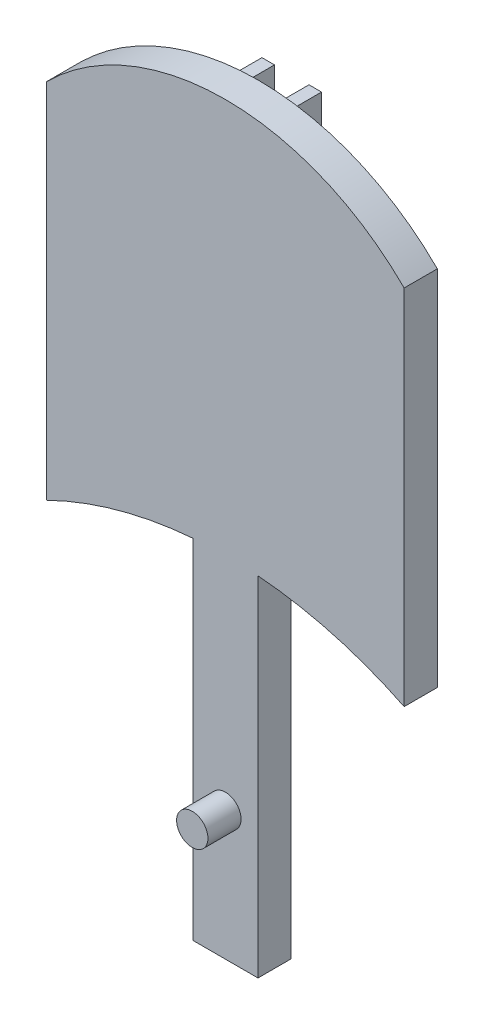
ISO-10303-21;
HEADER;
FILE_DESCRIPTION(('STEP AP214'),'2;1');
FILE_NAME('part.step','',(''),(''),'','','');
FILE_SCHEMA(('AUTOMOTIVE_DESIGN { 1 0 10303 214 1 1 1 1 }'));
ENDSEC;
DATA;
#1=APPLICATION_CONTEXT('core data for automotive mechanical design processes');
#2=APPLICATION_PROTOCOL_DEFINITION('international standard','automotive_design',2000,#1);
#3=PRODUCT_CONTEXT('',#1,'mechanical');
#4=PRODUCT('Part','Part','',(#3));
#5=PRODUCT_RELATED_PRODUCT_CATEGORY('part','',(#4));
#6=PRODUCT_DEFINITION_FORMATION('','',#4);
#7=PRODUCT_DEFINITION_CONTEXT('part definition',#1,'design');
#8=PRODUCT_DEFINITION('design','',#6,#7);
#9=PRODUCT_DEFINITION_SHAPE('','',#8);
#10=(LENGTH_UNIT() NAMED_UNIT(*) SI_UNIT(.MILLI.,.METRE.));
#11=(NAMED_UNIT(*) PLANE_ANGLE_UNIT() SI_UNIT($,.RADIAN.));
#12=(NAMED_UNIT(*) SI_UNIT($,.STERADIAN.) SOLID_ANGLE_UNIT());
#13=UNCERTAINTY_MEASURE_WITH_UNIT(LENGTH_MEASURE(1.E-05),#10,'distance_accuracy_value','');
#14=(GEOMETRIC_REPRESENTATION_CONTEXT(3) GLOBAL_UNCERTAINTY_ASSIGNED_CONTEXT((#13)) GLOBAL_UNIT_ASSIGNED_CONTEXT((#10,
#11,#12)) REPRESENTATION_CONTEXT('',''));
#15=CARTESIAN_POINT('',(0.,0.,0.));
#16=DIRECTION('',(0.,0.,1.));
#17=DIRECTION('',(1.,0.,0.));
#18=AXIS2_PLACEMENT_3D('',#15,#16,#17);
#19=CARTESIAN_POINT('',(0.,-52.2146947063219,3.175));
#20=DIRECTION('',(0.,0.,-1.));
#21=DIRECTION('',(-1.,0.,0.));
#22=AXIS2_PLACEMENT_3D('',#19,#20,#21);
#23=CYLINDRICAL_SURFACE('',#22,38.8318920153463);
#24=CARTESIAN_POINT('',(0.,-52.2146947063219,3.175));
#25=DIRECTION('',(0.,0.,1.));
#26=DIRECTION('',(1.,0.,0.));
#27=AXIS2_PLACEMENT_3D('',#24,#25,#26);
#28=CIRCLE('',#27,38.8318920153463);
#29=CARTESIAN_POINT('',(3.11847985069034,-13.5082234009658,3.175));
#30=VERTEX_POINT('',#29);
#31=CARTESIAN_POINT('',(17.1142533328683,-17.3575839489754,3.175));
#32=VERTEX_POINT('',#31);
#33=EDGE_CURVE('E260',#30,#32,#28,.F.);
#34=ORIENTED_EDGE('',*,*,#33,.F.);
#35=DIRECTION('',(0.,0.,-1.));
#36=VECTOR('',#35,1.);
#37=CARTESIAN_POINT('',(3.11847985069034,-13.5082234009658,3.175));
#38=LINE('',#37,#36);
#39=CARTESIAN_POINT('',(3.11847985069034,-13.5082234009658,0.));
#40=VERTEX_POINT('',#39);
#41=EDGE_CURVE('E193',#30,#40,#38,.T.);
#42=ORIENTED_EDGE('',*,*,#41,.T.);
#43=CARTESIAN_POINT('',(0.,-52.2146947063219,0.));
#44=DIRECTION('',(0.,0.,1.));
#45=DIRECTION('',(1.,0.,0.));
#46=AXIS2_PLACEMENT_3D('',#43,#44,#45);
#47=CIRCLE('',#46,38.8318920153463);
#48=CARTESIAN_POINT('',(17.1142533328683,-17.3575839489754,0.));
#49=VERTEX_POINT('',#48);
#50=EDGE_CURVE('E272',#40,#49,#47,.F.);
#51=ORIENTED_EDGE('',*,*,#50,.T.);
#52=DIRECTION('',(0.,0.,-1.));
#53=VECTOR('',#52,1.);
#54=CARTESIAN_POINT('',(17.1142533328683,-17.3575839489754,3.175));
#55=LINE('',#54,#53);
#56=EDGE_CURVE('E278',#32,#49,#55,.T.);
#57=ORIENTED_EDGE('',*,*,#56,.F.);
#58=EDGE_LOOP('',(#34,#42,#51,#57));
#59=FACE_BOUND('',#58,.T.);
#60=ADVANCED_FACE('F41',(#59),#23,.F.);
#61=CARTESIAN_POINT('',(0.,-52.2146947063219,0.));
#62=DIRECTION('',(0.,0.,1.));
#63=DIRECTION('',(1.,0.,0.));
#64=AXIS2_PLACEMENT_3D('',#61,#62,#63);
#65=CIRCLE('',#64,38.8318920153463);
#66=CARTESIAN_POINT('',(-2.85342673515783,-13.4877816695383,0.));
#67=VERTEX_POINT('',#66);
#68=CARTESIAN_POINT('',(-1.65128861988301,-13.4179283025949,0.));
#69=VERTEX_POINT('',#68);
#70=EDGE_CURVE('E190',#67,#69,#65,.F.);
#71=ORIENTED_EDGE('',*,*,#70,.F.);
#72=DIRECTION('',(0.,0.,1.));
#73=VECTOR('',#72,1.);
#74=CARTESIAN_POINT('',(-2.85342673515783,-13.4877816695383,-3.175));
#75=LINE('',#74,#73);
#76=CARTESIAN_POINT('',(-2.85342673515783,-13.4877816695383,-3.175));
#77=VERTEX_POINT('',#76);
#78=EDGE_CURVE('E211',#77,#67,#75,.T.);
#79=ORIENTED_EDGE('',*,*,#78,.F.);
#80=CARTESIAN_POINT('',(0.,-52.2146947063219,-3.175));
#81=DIRECTION('',(0.,0.,-1.));
#82=DIRECTION('',(-1.,0.,0.));
#83=AXIS2_PLACEMENT_3D('',#80,#81,#82);
#84=CIRCLE('',#83,38.8318920153463);
#85=CARTESIAN_POINT('',(-1.65128861988301,-13.4179283025949,-3.175));
#86=VERTEX_POINT('',#85);
#87=EDGE_CURVE('E225',#86,#77,#84,.F.);
#88=ORIENTED_EDGE('',*,*,#87,.F.);
#89=DIRECTION('',(0.,0.,1.));
#90=VECTOR('',#89,1.);
#91=CARTESIAN_POINT('',(-1.65128861988301,-13.4179283025949,-3.175));
#92=LINE('',#91,#90);
#93=EDGE_CURVE('E237',#86,#69,#92,.T.);
#94=ORIENTED_EDGE('',*,*,#93,.T.);
#95=EDGE_LOOP('',(#71,#79,#88,#94));
#96=FACE_BOUND('',#95,.T.);
#97=ADVANCED_FACE('F330',(#96),#23,.F.);
#98=CARTESIAN_POINT('',(1.65128861988301,-13.4179283025949,0.));
#99=VERTEX_POINT('',#98);
#100=CARTESIAN_POINT('',(2.85342673515783,-13.4877816695383,0.));
#101=VERTEX_POINT('',#100);
#102=EDGE_CURVE('E188',#99,#101,#65,.F.);
#103=ORIENTED_EDGE('',*,*,#102,.F.);
#104=DIRECTION('',(0.,0.,1.));
#105=VECTOR('',#104,1.);
#106=CARTESIAN_POINT('',(1.65128861988301,-13.4179283025949,-3.175));
#107=LINE('',#106,#105);
#108=CARTESIAN_POINT('',(1.65128861988301,-13.4179283025949,-3.175));
#109=VERTEX_POINT('',#108);
#110=EDGE_CURVE('E208',#109,#99,#107,.T.);
#111=ORIENTED_EDGE('',*,*,#110,.F.);
#112=CARTESIAN_POINT('',(0.,-52.2146947063219,-3.175));
#113=DIRECTION('',(0.,0.,-1.));
#114=DIRECTION('',(-1.,0.,0.));
#115=AXIS2_PLACEMENT_3D('',#112,#113,#114);
#116=CIRCLE('',#115,38.8318920153463);
#117=CARTESIAN_POINT('',(2.85342673515783,-13.4877816695383,-3.175));
#118=VERTEX_POINT('',#117);
#119=EDGE_CURVE('E206',#118,#109,#116,.F.);
#120=ORIENTED_EDGE('',*,*,#119,.F.);
#121=DIRECTION('',(0.,0.,1.));
#122=VECTOR('',#121,1.);
#123=CARTESIAN_POINT('',(2.85342673515783,-13.4877816695383,-3.175));
#124=LINE('',#123,#122);
#125=EDGE_CURVE('E216',#118,#101,#124,.T.);
#126=ORIENTED_EDGE('',*,*,#125,.T.);
#127=EDGE_LOOP('',(#103,#111,#120,#126));
#128=FACE_BOUND('',#127,.T.);
#129=ADVANCED_FACE('F336',(#128),#23,.F.);
#130=CARTESIAN_POINT('',(0.,0.,0.));
#131=DIRECTION('',(0.,0.,1.));
#132=DIRECTION('',(1.,0.,0.));
#133=AXIS2_PLACEMENT_3D('',#130,#131,#132);
#134=PLANE('',#133);
#135=DIRECTION('',(0.,-1.,0.));
#136=VECTOR('',#135,1.);
#137=CARTESIAN_POINT('',(-3.11847985069032,0.338888516574702,0.));
#138=LINE('',#137,#136);
#139=CARTESIAN_POINT('',(-3.11847985069032,-13.5082234009658,0.));
#140=VERTEX_POINT('',#139);
#141=CARTESIAN_POINT('',(-3.11847985069032,-46.8558230045354,0.));
#142=VERTEX_POINT('',#141);
#143=EDGE_CURVE('E156',#140,#142,#138,.T.);
#144=ORIENTED_EDGE('',*,*,#143,.F.);
#145=CARTESIAN_POINT('',(-17.1142533328683,-17.3575839489754,0.));
#146=VERTEX_POINT('',#145);
#147=EDGE_CURVE('E273',#146,#140,#47,.F.);
#148=ORIENTED_EDGE('',*,*,#147,.F.);
#149=DIRECTION('',(0.,1.,0.));
#150=VECTOR('',#149,1.);
#151=CARTESIAN_POINT('',(-17.1142533328683,0.,0.));
#152=LINE('',#151,#150);
#153=CARTESIAN_POINT('',(-17.1142533328683,17.3575839489754,0.));
#154=VERTEX_POINT('',#153);
#155=EDGE_CURVE('E269',#146,#154,#152,.T.);
#156=ORIENTED_EDGE('',*,*,#155,.T.);
#157=CARTESIAN_POINT('',(0.,0.194287236116569,0.));
#158=DIRECTION('',(0.,0.,1.));
#159=DIRECTION('',(1.,0.,0.));
#160=AXIS2_PLACEMENT_3D('',#157,#158,#159);
#161=CIRCLE('',#160,24.2379128885971);
#162=CARTESIAN_POINT('',(17.1142533328683,17.3575839489754,0.));
#163=VERTEX_POINT('',#162);
#164=EDGE_CURVE('E224',#154,#163,#161,.F.);
#165=ORIENTED_EDGE('',*,*,#164,.T.);
#166=DIRECTION('',(0.,1.,0.));
#167=VECTOR('',#166,1.);
#168=CARTESIAN_POINT('',(17.1142533328683,0.,0.));
#169=LINE('',#168,#167);
#170=EDGE_CURVE('E257',#49,#163,#169,.T.);
#171=ORIENTED_EDGE('',*,*,#170,.F.);
#172=ORIENTED_EDGE('',*,*,#50,.F.);
#173=DIRECTION('',(0.,1.,0.));
#174=VECTOR('',#173,1.);
#175=CARTESIAN_POINT('',(3.11847985069032,0.338888516574709,0.));
#176=LINE('',#175,#174);
#177=CARTESIAN_POINT('',(3.1184798506904,-46.8558230045354,0.));
#178=VERTEX_POINT('',#177);
#179=EDGE_CURVE('E168',#178,#40,#176,.T.);
#180=ORIENTED_EDGE('',*,*,#179,.F.);
#181=DIRECTION('',(1.,0.,0.));
#182=VECTOR('',#181,1.);
#183=CARTESIAN_POINT('',(-3.11847985069032,-46.8558230045354,0.));
#184=LINE('',#183,#182);
#185=EDGE_CURVE('E167',#142,#178,#184,.T.);
#186=ORIENTED_EDGE('',*,*,#185,.F.);
#187=EDGE_LOOP('',(#144,#148,#156,#165,#171,#172,#180,#186));
#188=FACE_BOUND('',#187,.T.);
#189=DIRECTION('',(0.,1.,0.));
#190=VECTOR('',#189,1.);
#191=CARTESIAN_POINT('',(2.85342673515783,0.,0.));
#192=LINE('',#191,#190);
#193=CARTESIAN_POINT('',(2.85342673515783,23.2983529403055,0.));
#194=VERTEX_POINT('',#193);
#195=EDGE_CURVE('E200',#101,#194,#192,.T.);
#196=ORIENTED_EDGE('',*,*,#195,.T.);
#197=DIRECTION('',(-1.,0.,0.));
#198=VECTOR('',#197,1.);
#199=CARTESIAN_POINT('',(0.,23.2983529403055,0.));
#200=LINE('',#199,#198);
#201=CARTESIAN_POINT('',(1.65128861988301,23.2983529403055,0.));
#202=VERTEX_POINT('',#201);
#203=EDGE_CURVE('E210',#194,#202,#200,.T.);
#204=ORIENTED_EDGE('',*,*,#203,.T.);
#205=DIRECTION('',(0.,1.,0.));
#206=VECTOR('',#205,1.);
#207=CARTESIAN_POINT('',(1.65128861988301,0.,0.));
#208=LINE('',#207,#206);
#209=EDGE_CURVE('E64',#99,#202,#208,.T.);
#210=ORIENTED_EDGE('',*,*,#209,.F.);
#211=ORIENTED_EDGE('',*,*,#102,.T.);
#212=EDGE_LOOP('',(#196,#204,#210,#211));
#213=FACE_BOUND('',#212,.T.);
#214=DIRECTION('',(0.,1.,0.));
#215=VECTOR('',#214,1.);
#216=CARTESIAN_POINT('',(-1.65128861988301,0.,0.));
#217=LINE('',#216,#215);
#218=CARTESIAN_POINT('',(-1.65128861988301,23.2983529403055,0.));
#219=VERTEX_POINT('',#218);
#220=EDGE_CURVE('E229',#69,#219,#217,.T.);
#221=ORIENTED_EDGE('',*,*,#220,.T.);
#222=DIRECTION('',(-1.,0.,0.));
#223=VECTOR('',#222,1.);
#224=CARTESIAN_POINT('',(0.,23.2983529403055,0.));
#225=LINE('',#224,#223);
#226=CARTESIAN_POINT('',(-2.85342673515783,23.2983529403055,0.));
#227=VERTEX_POINT('',#226);
#228=EDGE_CURVE('E239',#219,#227,#225,.T.);
#229=ORIENTED_EDGE('',*,*,#228,.T.);
#230=DIRECTION('',(0.,1.,0.));
#231=VECTOR('',#230,1.);
#232=CARTESIAN_POINT('',(-2.85342673515783,0.,0.));
#233=LINE('',#232,#231);
#234=EDGE_CURVE('E196',#67,#227,#233,.T.);
#235=ORIENTED_EDGE('',*,*,#234,.F.);
#236=ORIENTED_EDGE('',*,*,#70,.T.);
#237=EDGE_LOOP('',(#221,#229,#235,#236));
#238=FACE_BOUND('',#237,.T.);
#239=ADVANCED_FACE('F177',(#188,#213,#238),#134,.F.);
#240=CARTESIAN_POINT('',(0.,0.194287236116569,3.175));
#241=DIRECTION('',(0.,0.,-1.));
#242=DIRECTION('',(-1.,0.,0.));
#243=AXIS2_PLACEMENT_3D('',#240,#241,#242);
#244=CYLINDRICAL_SURFACE('',#243,24.2379128885971);
#245=ORIENTED_EDGE('',*,*,#164,.F.);
#246=DIRECTION('',(0.,0.,-1.));
#247=VECTOR('',#246,1.);
#248=CARTESIAN_POINT('',(-17.1142533328683,17.3575839489754,3.175));
#249=LINE('',#248,#247);
#250=CARTESIAN_POINT('',(-17.1142533328683,17.3575839489754,3.175));
#251=VERTEX_POINT('',#250);
#252=EDGE_CURVE('E11',#251,#154,#249,.T.);
#253=ORIENTED_EDGE('',*,*,#252,.F.);
#254=CARTESIAN_POINT('',(0.,0.194287236116569,3.175));
#255=DIRECTION('',(0.,0.,1.));
#256=DIRECTION('',(1.,0.,0.));
#257=AXIS2_PLACEMENT_3D('',#254,#255,#256);
#258=CIRCLE('',#257,24.2379128885971);
#259=CARTESIAN_POINT('',(17.1142533328683,17.3575839489754,3.175));
#260=VERTEX_POINT('',#259);
#261=EDGE_CURVE('E253',#251,#260,#258,.F.);
#262=ORIENTED_EDGE('',*,*,#261,.T.);
#263=DIRECTION('',(0.,0.,-1.));
#264=VECTOR('',#263,1.);
#265=CARTESIAN_POINT('',(17.1142533328683,17.3575839489754,3.175));
#266=LINE('',#265,#264);
#267=EDGE_CURVE('E266',#260,#163,#266,.T.);
#268=ORIENTED_EDGE('',*,*,#267,.T.);
#269=EDGE_LOOP('',(#245,#253,#262,#268));
#270=FACE_BOUND('',#269,.T.);
#271=ADVANCED_FACE('F43',(#270),#244,.T.);
#272=CARTESIAN_POINT('',(-17.1142533328683,0.,3.175));
#273=DIRECTION('',(-1.,0.,0.));
#274=DIRECTION('',(0.,0.,1.));
#275=AXIS2_PLACEMENT_3D('',#272,#273,#274);
#276=PLANE('',#275);
#277=ORIENTED_EDGE('',*,*,#155,.F.);
#278=DIRECTION('',(0.,0.,-1.));
#279=VECTOR('',#278,1.);
#280=CARTESIAN_POINT('',(-17.1142533328683,-17.3575839489754,3.175));
#281=LINE('',#280,#279);
#282=CARTESIAN_POINT('',(-17.1142533328683,-17.3575839489754,3.175));
#283=VERTEX_POINT('',#282);
#284=EDGE_CURVE('E49',#283,#146,#281,.T.);
#285=ORIENTED_EDGE('',*,*,#284,.F.);
#286=DIRECTION('',(0.,1.,0.));
#287=VECTOR('',#286,1.);
#288=CARTESIAN_POINT('',(-17.1142533328683,0.,3.175));
#289=LINE('',#288,#287);
#290=EDGE_CURVE('E256',#283,#251,#289,.T.);
#291=ORIENTED_EDGE('',*,*,#290,.T.);
#292=ORIENTED_EDGE('',*,*,#252,.T.);
#293=EDGE_LOOP('',(#277,#285,#291,#292));
#294=FACE_BOUND('',#293,.T.);
#295=ADVANCED_FACE('F286',(#294),#276,.T.);
#296=ORIENTED_EDGE('',*,*,#147,.T.);
#297=DIRECTION('',(0.,0.,-1.));
#298=VECTOR('',#297,1.);
#299=CARTESIAN_POINT('',(-3.11847985069032,-13.5082234009658,3.175));
#300=LINE('',#299,#298);
#301=CARTESIAN_POINT('',(-3.11847985069032,-13.5082234009658,3.175));
#302=VERTEX_POINT('',#301);
#303=EDGE_CURVE('E162',#140,#302,#300,.F.);
#304=ORIENTED_EDGE('',*,*,#303,.T.);
#305=EDGE_CURVE('E261',#283,#302,#28,.F.);
#306=ORIENTED_EDGE('',*,*,#305,.F.);
#307=ORIENTED_EDGE('',*,*,#284,.T.);
#308=EDGE_LOOP('',(#296,#304,#306,#307));
#309=FACE_BOUND('',#308,.T.);
#310=ADVANCED_FACE('F282',(#309),#23,.F.);
#311=CARTESIAN_POINT('',(17.1142533328683,0.,3.175));
#312=DIRECTION('',(-1.,0.,0.));
#313=DIRECTION('',(0.,0.,1.));
#314=AXIS2_PLACEMENT_3D('',#311,#312,#313);
#315=PLANE('',#314);
#316=ORIENTED_EDGE('',*,*,#170,.T.);
#317=ORIENTED_EDGE('',*,*,#267,.F.);
#318=DIRECTION('',(0.,1.,0.));
#319=VECTOR('',#318,1.);
#320=CARTESIAN_POINT('',(17.1142533328683,0.,3.175));
#321=LINE('',#320,#319);
#322=EDGE_CURVE('E264',#32,#260,#321,.T.);
#323=ORIENTED_EDGE('',*,*,#322,.F.);
#324=ORIENTED_EDGE('',*,*,#56,.T.);
#325=EDGE_LOOP('',(#316,#317,#323,#324));
#326=FACE_BOUND('',#325,.T.);
#327=ADVANCED_FACE('F293',(#326),#315,.F.);
#328=CARTESIAN_POINT('',(0.,0.,3.175));
#329=DIRECTION('',(0.,0.,1.));
#330=DIRECTION('',(1.,0.,0.));
#331=AXIS2_PLACEMENT_3D('',#328,#329,#330);
#332=PLANE('',#331);
#333=CARTESIAN_POINT('',(0.,-34.5036834153857,3.175));
#334=DIRECTION('',(0.,0.,1.));
#335=DIRECTION('',(1.,0.,0.));
#336=AXIS2_PLACEMENT_3D('',#333,#334,#335);
#337=CIRCLE('',#336,1.5);
#338=CARTESIAN_POINT('',(1.5,-34.5036834153857,3.175));
#339=VERTEX_POINT('',#338);
#340=EDGE_CURVE('E301',#339,#339,#337,.T.);
#341=ORIENTED_EDGE('',*,*,#340,.F.);
#342=EDGE_LOOP('',(#341));
#343=FACE_BOUND('',#342,.T.);
#344=ORIENTED_EDGE('',*,*,#305,.T.);
#345=DIRECTION('',(0.,-1.,0.));
#346=VECTOR('',#345,1.);
#347=CARTESIAN_POINT('',(-3.11847985069032,0.338888516574702,3.175));
#348=LINE('',#347,#346);
#349=CARTESIAN_POINT('',(-3.11847985069032,-46.8558230045354,3.175));
#350=VERTEX_POINT('',#349);
#351=EDGE_CURVE('E184',#302,#350,#348,.T.);
#352=ORIENTED_EDGE('',*,*,#351,.T.);
#353=DIRECTION('',(1.,0.,0.));
#354=VECTOR('',#353,1.);
#355=CARTESIAN_POINT('',(-3.11847985069032,-46.8558230045354,3.175));
#356=LINE('',#355,#354);
#357=CARTESIAN_POINT('',(3.1184798506904,-46.8558230045354,3.175));
#358=VERTEX_POINT('',#357);
#359=EDGE_CURVE('E173',#350,#358,#356,.T.);
#360=ORIENTED_EDGE('',*,*,#359,.T.);
#361=DIRECTION('',(0.,1.,0.));
#362=VECTOR('',#361,1.);
#363=CARTESIAN_POINT('',(3.11847985069032,0.338888516574709,3.175));
#364=LINE('',#363,#362);
#365=EDGE_CURVE('E56',#358,#30,#364,.T.);
#366=ORIENTED_EDGE('',*,*,#365,.T.);
#367=ORIENTED_EDGE('',*,*,#33,.T.);
#368=ORIENTED_EDGE('',*,*,#322,.T.);
#369=ORIENTED_EDGE('',*,*,#261,.F.);
#370=ORIENTED_EDGE('',*,*,#290,.F.);
#371=EDGE_LOOP('',(#344,#352,#360,#366,#367,#368,#369,#370));
#372=FACE_BOUND('',#371,.T.);
#373=ADVANCED_FACE('F315',(#343,#372),#332,.T.);
#374=CARTESIAN_POINT('',(-2.85342673515783,0.,-3.175));
#375=DIRECTION('',(1.,0.,0.));
#376=DIRECTION('',(0.,0.,-1.));
#377=AXIS2_PLACEMENT_3D('',#374,#375,#376);
#378=PLANE('',#377);
#379=ORIENTED_EDGE('',*,*,#234,.T.);
#380=DIRECTION('',(0.,0.,1.));
#381=VECTOR('',#380,1.);
#382=CARTESIAN_POINT('',(-2.85342673515783,23.2983529403055,-3.175));
#383=LINE('',#382,#381);
#384=CARTESIAN_POINT('',(-2.85342673515783,23.2983529403055,-3.175));
#385=VERTEX_POINT('',#384);
#386=EDGE_CURVE('E248',#385,#227,#383,.T.);
#387=ORIENTED_EDGE('',*,*,#386,.F.);
#388=DIRECTION('',(0.,1.,0.));
#389=VECTOR('',#388,1.);
#390=CARTESIAN_POINT('',(-2.85342673515783,0.,-3.175));
#391=LINE('',#390,#389);
#392=EDGE_CURVE('E228',#77,#385,#391,.T.);
#393=ORIENTED_EDGE('',*,*,#392,.F.);
#394=ORIENTED_EDGE('',*,*,#78,.T.);
#395=EDGE_LOOP('',(#379,#387,#393,#394));
#396=FACE_BOUND('',#395,.T.);
#397=ADVANCED_FACE('F317',(#396),#378,.F.);
#398=CARTESIAN_POINT('',(0.,23.2983529403055,-3.175));
#399=DIRECTION('',(0.,1.,0.));
#400=DIRECTION('',(0.,0.,1.));
#401=AXIS2_PLACEMENT_3D('',#398,#399,#400);
#402=PLANE('',#401);
#403=ORIENTED_EDGE('',*,*,#228,.F.);
#404=DIRECTION('',(0.,0.,1.));
#405=VECTOR('',#404,1.);
#406=CARTESIAN_POINT('',(-1.65128861988301,23.2983529403055,-3.175));
#407=LINE('',#406,#405);
#408=CARTESIAN_POINT('',(-1.65128861988301,23.2983529403055,-3.175));
#409=VERTEX_POINT('',#408);
#410=EDGE_CURVE('E245',#409,#219,#407,.T.);
#411=ORIENTED_EDGE('',*,*,#410,.F.);
#412=DIRECTION('',(-1.,0.,0.));
#413=VECTOR('',#412,1.);
#414=CARTESIAN_POINT('',(0.,23.2983529403055,-3.175));
#415=LINE('',#414,#413);
#416=EDGE_CURVE('E231',#409,#385,#415,.T.);
#417=ORIENTED_EDGE('',*,*,#416,.T.);
#418=ORIENTED_EDGE('',*,*,#386,.T.);
#419=EDGE_LOOP('',(#403,#411,#417,#418));
#420=FACE_BOUND('',#419,.T.);
#421=ADVANCED_FACE('F323',(#420),#402,.T.);
#422=CARTESIAN_POINT('',(-1.65128861988301,0.,-3.175));
#423=DIRECTION('',(1.,0.,0.));
#424=DIRECTION('',(0.,0.,-1.));
#425=AXIS2_PLACEMENT_3D('',#422,#423,#424);
#426=PLANE('',#425);
#427=ORIENTED_EDGE('',*,*,#220,.F.);
#428=ORIENTED_EDGE('',*,*,#93,.F.);
#429=DIRECTION('',(0.,1.,0.));
#430=VECTOR('',#429,1.);
#431=CARTESIAN_POINT('',(-1.65128861988301,0.,-3.175));
#432=LINE('',#431,#430);
#433=EDGE_CURVE('E234',#86,#409,#432,.T.);
#434=ORIENTED_EDGE('',*,*,#433,.T.);
#435=ORIENTED_EDGE('',*,*,#410,.T.);
#436=EDGE_LOOP('',(#427,#428,#434,#435));
#437=FACE_BOUND('',#436,.T.);
#438=ADVANCED_FACE('F377',(#437),#426,.T.);
#439=CARTESIAN_POINT('',(0.,0.,-3.175));
#440=DIRECTION('',(0.,0.,-1.));
#441=DIRECTION('',(-1.,0.,0.));
#442=AXIS2_PLACEMENT_3D('',#439,#440,#441);
#443=PLANE('',#442);
#444=ORIENTED_EDGE('',*,*,#87,.T.);
#445=ORIENTED_EDGE('',*,*,#392,.T.);
#446=ORIENTED_EDGE('',*,*,#416,.F.);
#447=ORIENTED_EDGE('',*,*,#433,.F.);
#448=EDGE_LOOP('',(#444,#445,#446,#447));
#449=FACE_BOUND('',#448,.T.);
#450=ADVANCED_FACE('F374',(#449),#443,.T.);
#451=CARTESIAN_POINT('',(1.65128861988301,0.,-3.175));
#452=DIRECTION('',(1.,0.,0.));
#453=DIRECTION('',(0.,0.,-1.));
#454=AXIS2_PLACEMENT_3D('',#451,#452,#453);
#455=PLANE('',#454);
#456=ORIENTED_EDGE('',*,*,#209,.T.);
#457=DIRECTION('',(0.,0.,1.));
#458=VECTOR('',#457,1.);
#459=CARTESIAN_POINT('',(1.65128861988301,23.2983529403055,-3.175));
#460=LINE('',#459,#458);
#461=CARTESIAN_POINT('',(1.65128861988301,23.2983529403055,-3.175));
#462=VERTEX_POINT('',#461);
#463=EDGE_CURVE('E222',#462,#202,#460,.T.);
#464=ORIENTED_EDGE('',*,*,#463,.F.);
#465=DIRECTION('',(0.,1.,0.));
#466=VECTOR('',#465,1.);
#467=CARTESIAN_POINT('',(1.65128861988301,0.,-3.175));
#468=LINE('',#467,#466);
#469=EDGE_CURVE('E197',#109,#462,#468,.T.);
#470=ORIENTED_EDGE('',*,*,#469,.F.);
#471=ORIENTED_EDGE('',*,*,#110,.T.);
#472=EDGE_LOOP('',(#456,#464,#470,#471));
#473=FACE_BOUND('',#472,.T.);
#474=ADVANCED_FACE('F351',(#473),#455,.F.);
#475=CARTESIAN_POINT('',(0.,23.2983529403055,-3.175));
#476=DIRECTION('',(0.,1.,0.));
#477=DIRECTION('',(0.,0.,1.));
#478=AXIS2_PLACEMENT_3D('',#475,#476,#477);
#479=PLANE('',#478);
#480=ORIENTED_EDGE('',*,*,#203,.F.);
#481=DIRECTION('',(0.,0.,1.));
#482=VECTOR('',#481,1.);
#483=CARTESIAN_POINT('',(2.85342673515783,23.2983529403055,-3.175));
#484=LINE('',#483,#482);
#485=CARTESIAN_POINT('',(2.85342673515783,23.2983529403055,-3.175));
#486=VERTEX_POINT('',#485);
#487=EDGE_CURVE('E219',#486,#194,#484,.T.);
#488=ORIENTED_EDGE('',*,*,#487,.F.);
#489=DIRECTION('',(-1.,0.,0.));
#490=VECTOR('',#489,1.);
#491=CARTESIAN_POINT('',(0.,23.2983529403055,-3.175));
#492=LINE('',#491,#490);
#493=EDGE_CURVE('E199',#486,#462,#492,.T.);
#494=ORIENTED_EDGE('',*,*,#493,.T.);
#495=ORIENTED_EDGE('',*,*,#463,.T.);
#496=EDGE_LOOP('',(#480,#488,#494,#495));
#497=FACE_BOUND('',#496,.T.);
#498=ADVANCED_FACE('F355',(#497),#479,.T.);
#499=CARTESIAN_POINT('',(2.85342673515783,0.,-3.175));
#500=DIRECTION('',(1.,0.,0.));
#501=DIRECTION('',(0.,0.,-1.));
#502=AXIS2_PLACEMENT_3D('',#499,#500,#501);
#503=PLANE('',#502);
#504=ORIENTED_EDGE('',*,*,#195,.F.);
#505=ORIENTED_EDGE('',*,*,#125,.F.);
#506=DIRECTION('',(0.,1.,0.));
#507=VECTOR('',#506,1.);
#508=CARTESIAN_POINT('',(2.85342673515783,0.,-3.175));
#509=LINE('',#508,#507);
#510=EDGE_CURVE('E203',#118,#486,#509,.T.);
#511=ORIENTED_EDGE('',*,*,#510,.T.);
#512=ORIENTED_EDGE('',*,*,#487,.T.);
#513=EDGE_LOOP('',(#504,#505,#511,#512));
#514=FACE_BOUND('',#513,.T.);
#515=ADVANCED_FACE('F361',(#514),#503,.T.);
#516=CARTESIAN_POINT('',(0.,0.,-3.175));
#517=DIRECTION('',(0.,0.,-1.));
#518=DIRECTION('',(-1.,0.,0.));
#519=AXIS2_PLACEMENT_3D('',#516,#517,#518);
#520=PLANE('',#519);
#521=ORIENTED_EDGE('',*,*,#469,.T.);
#522=ORIENTED_EDGE('',*,*,#493,.F.);
#523=ORIENTED_EDGE('',*,*,#510,.F.);
#524=ORIENTED_EDGE('',*,*,#119,.T.);
#525=EDGE_LOOP('',(#521,#522,#523,#524));
#526=FACE_BOUND('',#525,.T.);
#527=ADVANCED_FACE('F359',(#526),#520,.T.);
#528=CARTESIAN_POINT('',(3.11847985069032,0.338888516574709,0.));
#529=DIRECTION('',(1.,0.,0.));
#530=DIRECTION('',(0.,1.,0.));
#531=AXIS2_PLACEMENT_3D('',#528,#529,#530);
#532=PLANE('',#531);
#533=ORIENTED_EDGE('',*,*,#41,.F.);
#534=ORIENTED_EDGE('',*,*,#365,.F.);
#535=DIRECTION('',(0.,0.,1.));
#536=VECTOR('',#535,1.);
#537=CARTESIAN_POINT('',(3.1184798506904,-46.8558230045354,0.));
#538=LINE('',#537,#536);
#539=EDGE_CURVE('E174',#178,#358,#538,.T.);
#540=ORIENTED_EDGE('',*,*,#539,.F.);
#541=ORIENTED_EDGE('',*,*,#179,.T.);
#542=EDGE_LOOP('',(#533,#534,#540,#541));
#543=FACE_BOUND('',#542,.T.);
#544=ADVANCED_FACE('F299',(#543),#532,.T.);
#545=CARTESIAN_POINT('',(-3.11847985069032,0.338888516574702,0.));
#546=DIRECTION('',(-1.,0.,0.));
#547=DIRECTION('',(0.,0.,1.));
#548=AXIS2_PLACEMENT_3D('',#545,#546,#547);
#549=PLANE('',#548);
#550=ORIENTED_EDGE('',*,*,#303,.F.);
#551=ORIENTED_EDGE('',*,*,#143,.T.);
#552=DIRECTION('',(0.,0.,1.));
#553=VECTOR('',#552,1.);
#554=CARTESIAN_POINT('',(-3.11847985069032,-46.8558230045354,0.));
#555=LINE('',#554,#553);
#556=EDGE_CURVE('E159',#142,#350,#555,.T.);
#557=ORIENTED_EDGE('',*,*,#556,.T.);
#558=ORIENTED_EDGE('',*,*,#351,.F.);
#559=EDGE_LOOP('',(#550,#551,#557,#558));
#560=FACE_BOUND('',#559,.T.);
#561=ADVANCED_FACE('F158',(#560),#549,.T.);
#562=CARTESIAN_POINT('',(-3.11847985069032,-46.8558230045354,0.));
#563=DIRECTION('',(0.,-1.,0.));
#564=DIRECTION('',(0.,0.,-1.));
#565=AXIS2_PLACEMENT_3D('',#562,#563,#564);
#566=PLANE('',#565);
#567=ORIENTED_EDGE('',*,*,#359,.F.);
#568=ORIENTED_EDGE('',*,*,#556,.F.);
#569=ORIENTED_EDGE('',*,*,#185,.T.);
#570=ORIENTED_EDGE('',*,*,#539,.T.);
#571=EDGE_LOOP('',(#567,#568,#569,#570));
#572=FACE_BOUND('',#571,.T.);
#573=ADVANCED_FACE('F172',(#572),#566,.T.);
#574=CARTESIAN_POINT('',(0.,-34.5036834153857,6.35));
#575=DIRECTION('',(0.,0.,-1.));
#576=DIRECTION('',(-1.,0.,0.));
#577=AXIS2_PLACEMENT_3D('',#574,#575,#576);
#578=CYLINDRICAL_SURFACE('',#577,1.5);
#579=CARTESIAN_POINT('',(0.,-34.5036834153857,6.35));
#580=DIRECTION('',(0.,0.,1.));
#581=DIRECTION('',(1.,0.,0.));
#582=AXIS2_PLACEMENT_3D('',#579,#580,#581);
#583=CIRCLE('',#582,1.5);
#584=CARTESIAN_POINT('',(1.5,-34.5036834153857,6.35));
#585=VERTEX_POINT('',#584);
#586=EDGE_CURVE('E185',#585,#585,#583,.T.);
#587=ORIENTED_EDGE('',*,*,#586,.F.);
#588=EDGE_LOOP('',(#587));
#589=FACE_BOUND('',#588,.T.);
#590=ORIENTED_EDGE('',*,*,#340,.T.);
#591=EDGE_LOOP('',(#590));
#592=FACE_BOUND('',#591,.T.);
#593=ADVANCED_FACE('F309',(#589,#592),#578,.T.);
#594=CARTESIAN_POINT('',(0.,0.,6.35));
#595=DIRECTION('',(0.,0.,1.));
#596=DIRECTION('',(1.,0.,0.));
#597=AXIS2_PLACEMENT_3D('',#594,#595,#596);
#598=PLANE('',#597);
#599=ORIENTED_EDGE('',*,*,#586,.T.);
#600=EDGE_LOOP('',(#599));
#601=FACE_BOUND('',#600,.T.);
#602=ADVANCED_FACE('F307',(#601),#598,.T.);
#603=CLOSED_SHELL('',(#60,#97,#129,#239,#271,#295,#310,#327,#373,#397,#421,#438,#450,#474,#498,
#515,#527,#544,#561,#573,#593,#602));
#604=MANIFOLD_SOLID_BREP('B2',#603);
#605=ADVANCED_BREP_SHAPE_REPRESENTATION('',(#18,#604),#14);
#606=SHAPE_DEFINITION_REPRESENTATION(#9,#605);
ENDSEC;
END-ISO-10303-21;
